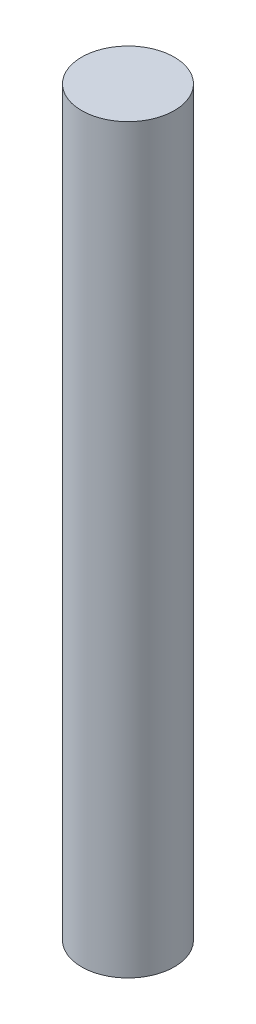
ISO-10303-21;
HEADER;
FILE_DESCRIPTION(('STEP AP214'),'2;1');
FILE_NAME('part.step','',(''),(''),'','','');
FILE_SCHEMA(('AUTOMOTIVE_DESIGN { 1 0 10303 214 1 1 1 1 }'));
ENDSEC;
DATA;
#1=APPLICATION_CONTEXT('core data for automotive mechanical design processes');
#2=APPLICATION_PROTOCOL_DEFINITION('international standard','automotive_design',2000,#1);
#3=PRODUCT_CONTEXT('',#1,'mechanical');
#4=PRODUCT('Part','Part','',(#3));
#5=PRODUCT_RELATED_PRODUCT_CATEGORY('part','',(#4));
#6=PRODUCT_DEFINITION_FORMATION('','',#4);
#7=PRODUCT_DEFINITION_CONTEXT('part definition',#1,'design');
#8=PRODUCT_DEFINITION('design','',#6,#7);
#9=PRODUCT_DEFINITION_SHAPE('','',#8);
#10=(LENGTH_UNIT() NAMED_UNIT(*) SI_UNIT(.MILLI.,.METRE.));
#11=(NAMED_UNIT(*) PLANE_ANGLE_UNIT() SI_UNIT($,.RADIAN.));
#12=(NAMED_UNIT(*) SI_UNIT($,.STERADIAN.) SOLID_ANGLE_UNIT());
#13=UNCERTAINTY_MEASURE_WITH_UNIT(LENGTH_MEASURE(1.E-05),#10,'distance_accuracy_value','');
#14=(GEOMETRIC_REPRESENTATION_CONTEXT(3) GLOBAL_UNCERTAINTY_ASSIGNED_CONTEXT((#13)) GLOBAL_UNIT_ASSIGNED_CONTEXT((#10,
#11,#12)) REPRESENTATION_CONTEXT('',''));
#15=CARTESIAN_POINT('',(0.,0.,0.));
#16=DIRECTION('',(0.,0.,1.));
#17=DIRECTION('',(1.,0.,0.));
#18=AXIS2_PLACEMENT_3D('',#15,#16,#17);
#19=CARTESIAN_POINT('',(0.,76.2,0.));
#20=DIRECTION('',(0.,-1.,0.));
#21=DIRECTION('',(0.,0.,-1.));
#22=AXIS2_PLACEMENT_3D('',#19,#20,#21);
#23=CYLINDRICAL_SURFACE('',#22,4.7625);
#24=CARTESIAN_POINT('',(0.,76.2,0.));
#25=DIRECTION('',(0.,1.,0.));
#26=DIRECTION('',(0.,0.,1.));
#27=AXIS2_PLACEMENT_3D('',#24,#25,#26);
#28=CIRCLE('',#27,4.7625);
#29=CARTESIAN_POINT('',(0.,76.2,4.7625));
#30=VERTEX_POINT('',#29);
#31=EDGE_CURVE('E10',#30,#30,#28,.T.);
#32=ORIENTED_EDGE('',*,*,#31,.F.);
#33=EDGE_LOOP('',(#32));
#34=FACE_BOUND('',#33,.T.);
#35=CARTESIAN_POINT('',(0.,0.,0.));
#36=DIRECTION('',(0.,1.,0.));
#37=DIRECTION('',(0.,0.,1.));
#38=AXIS2_PLACEMENT_3D('',#35,#36,#37);
#39=CIRCLE('',#38,4.7625);
#40=CARTESIAN_POINT('',(0.,0.,4.7625));
#41=VERTEX_POINT('',#40);
#42=EDGE_CURVE('E35',#41,#41,#39,.T.);
#43=ORIENTED_EDGE('',*,*,#42,.T.);
#44=EDGE_LOOP('',(#43));
#45=FACE_BOUND('',#44,.T.);
#46=ADVANCED_FACE('F32',(#34,#45),#23,.T.);
#47=CARTESIAN_POINT('',(0.,76.2,0.));
#48=DIRECTION('',(0.,1.,0.));
#49=DIRECTION('',(0.,0.,1.));
#50=AXIS2_PLACEMENT_3D('',#47,#48,#49);
#51=PLANE('',#50);
#52=ORIENTED_EDGE('',*,*,#31,.T.);
#53=EDGE_LOOP('',(#52));
#54=FACE_BOUND('',#53,.T.);
#55=ADVANCED_FACE('F47',(#54),#51,.T.);
#56=CARTESIAN_POINT('',(0.,0.,0.));
#57=DIRECTION('',(0.,1.,0.));
#58=DIRECTION('',(0.,0.,1.));
#59=AXIS2_PLACEMENT_3D('',#56,#57,#58);
#60=PLANE('',#59);
#61=ORIENTED_EDGE('',*,*,#42,.F.);
#62=EDGE_LOOP('',(#61));
#63=FACE_BOUND('',#62,.T.);
#64=ADVANCED_FACE('F45',(#63),#60,.F.);
#65=CLOSED_SHELL('',(#46,#55,#64));
#66=MANIFOLD_SOLID_BREP('B2',#65);
#67=ADVANCED_BREP_SHAPE_REPRESENTATION('',(#18,#66),#14);
#68=SHAPE_DEFINITION_REPRESENTATION(#9,#67);
ENDSEC;
END-ISO-10303-21;
